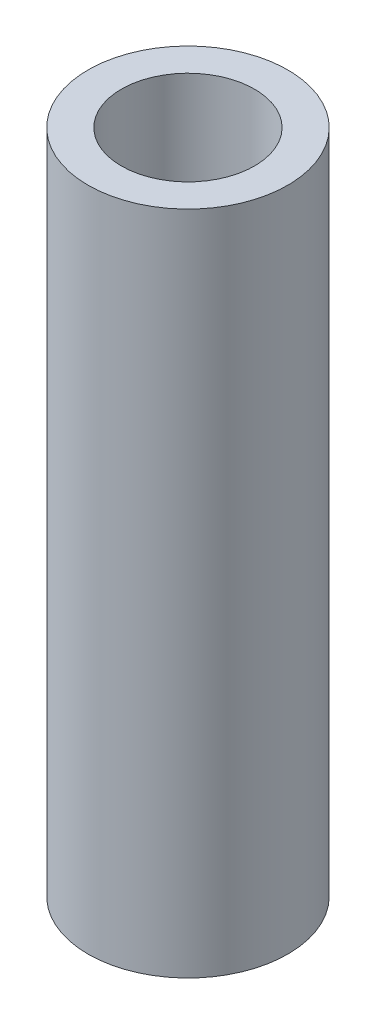
ISO-10303-21;
HEADER;
FILE_DESCRIPTION(('STEP AP214'),'2;1');
FILE_NAME('part.step','',(''),(''),'','','');
FILE_SCHEMA(('AUTOMOTIVE_DESIGN { 1 0 10303 214 1 1 1 1 }'));
ENDSEC;
DATA;
#1=APPLICATION_CONTEXT('core data for automotive mechanical design processes');
#2=APPLICATION_PROTOCOL_DEFINITION('international standard','automotive_design',2000,#1);
#3=PRODUCT_CONTEXT('',#1,'mechanical');
#4=PRODUCT('Part','Part','',(#3));
#5=PRODUCT_RELATED_PRODUCT_CATEGORY('part','',(#4));
#6=PRODUCT_DEFINITION_FORMATION('','',#4);
#7=PRODUCT_DEFINITION_CONTEXT('part definition',#1,'design');
#8=PRODUCT_DEFINITION('design','',#6,#7);
#9=PRODUCT_DEFINITION_SHAPE('','',#8);
#10=(LENGTH_UNIT() NAMED_UNIT(*) SI_UNIT(.MILLI.,.METRE.));
#11=(NAMED_UNIT(*) PLANE_ANGLE_UNIT() SI_UNIT($,.RADIAN.));
#12=(NAMED_UNIT(*) SI_UNIT($,.STERADIAN.) SOLID_ANGLE_UNIT());
#13=UNCERTAINTY_MEASURE_WITH_UNIT(LENGTH_MEASURE(1.E-05),#10,'distance_accuracy_value','');
#14=(GEOMETRIC_REPRESENTATION_CONTEXT(3) GLOBAL_UNCERTAINTY_ASSIGNED_CONTEXT((#13)) GLOBAL_UNIT_ASSIGNED_CONTEXT((#10,
#11,#12)) REPRESENTATION_CONTEXT('',''));
#15=CARTESIAN_POINT('',(0.,0.,0.));
#16=DIRECTION('',(0.,0.,1.));
#17=DIRECTION('',(1.,0.,0.));
#18=AXIS2_PLACEMENT_3D('',#15,#16,#17);
#19=CARTESIAN_POINT('',(0.,20.,0.));
#20=DIRECTION('',(0.,-1.,0.));
#21=DIRECTION('',(0.,0.,-1.));
#22=AXIS2_PLACEMENT_3D('',#19,#20,#21);
#23=CYLINDRICAL_SURFACE('',#22,3.);
#24=CARTESIAN_POINT('',(0.,20.,0.));
#25=DIRECTION('',(0.,1.,0.));
#26=DIRECTION('',(0.,0.,1.));
#27=AXIS2_PLACEMENT_3D('',#24,#25,#26);
#28=CIRCLE('',#27,3.);
#29=CARTESIAN_POINT('',(0.,20.,3.));
#30=VERTEX_POINT('',#29);
#31=EDGE_CURVE('E10',#30,#30,#28,.T.);
#32=ORIENTED_EDGE('',*,*,#31,.F.);
#33=EDGE_LOOP('',(#32));
#34=FACE_BOUND('',#33,.T.);
#35=CARTESIAN_POINT('',(0.,0.,0.));
#36=DIRECTION('',(0.,1.,0.));
#37=DIRECTION('',(0.,0.,1.));
#38=AXIS2_PLACEMENT_3D('',#35,#36,#37);
#39=CIRCLE('',#38,3.);
#40=CARTESIAN_POINT('',(0.,0.,3.));
#41=VERTEX_POINT('',#40);
#42=EDGE_CURVE('E34',#41,#41,#39,.T.);
#43=ORIENTED_EDGE('',*,*,#42,.T.);
#44=EDGE_LOOP('',(#43));
#45=FACE_BOUND('',#44,.T.);
#46=ADVANCED_FACE('F31',(#34,#45),#23,.T.);
#47=CARTESIAN_POINT('',(0.,20.,0.));
#48=DIRECTION('',(0.,1.,0.));
#49=DIRECTION('',(0.,0.,1.));
#50=AXIS2_PLACEMENT_3D('',#47,#48,#49);
#51=PLANE('',#50);
#52=CARTESIAN_POINT('',(0.,20.,0.));
#53=DIRECTION('',(0.,1.,0.));
#54=DIRECTION('',(0.,0.,1.));
#55=AXIS2_PLACEMENT_3D('',#52,#53,#54);
#56=CIRCLE('',#55,2.);
#57=CARTESIAN_POINT('',(0.,20.,2.));
#58=VERTEX_POINT('',#57);
#59=EDGE_CURVE('E43',#58,#58,#56,.T.);
#60=ORIENTED_EDGE('',*,*,#59,.F.);
#61=EDGE_LOOP('',(#60));
#62=FACE_BOUND('',#61,.T.);
#63=ORIENTED_EDGE('',*,*,#31,.T.);
#64=EDGE_LOOP('',(#63));
#65=FACE_BOUND('',#64,.T.);
#66=ADVANCED_FACE('F58',(#62,#65),#51,.T.);
#67=CARTESIAN_POINT('',(0.,0.,0.));
#68=DIRECTION('',(0.,1.,0.));
#69=DIRECTION('',(0.,0.,1.));
#70=AXIS2_PLACEMENT_3D('',#67,#68,#69);
#71=PLANE('',#70);
#72=CARTESIAN_POINT('',(0.,0.,0.));
#73=DIRECTION('',(0.,1.,0.));
#74=DIRECTION('',(0.,0.,1.));
#75=AXIS2_PLACEMENT_3D('',#72,#73,#74);
#76=CIRCLE('',#75,2.);
#77=CARTESIAN_POINT('',(0.,0.,2.));
#78=VERTEX_POINT('',#77);
#79=EDGE_CURVE('E41',#78,#78,#76,.T.);
#80=ORIENTED_EDGE('',*,*,#79,.T.);
#81=EDGE_LOOP('',(#80));
#82=FACE_BOUND('',#81,.T.);
#83=ORIENTED_EDGE('',*,*,#42,.F.);
#84=EDGE_LOOP('',(#83));
#85=FACE_BOUND('',#84,.T.);
#86=ADVANCED_FACE('F49',(#82,#85),#71,.F.);
#87=CARTESIAN_POINT('',(0.,0.,0.));
#88=DIRECTION('',(0.,1.,0.));
#89=DIRECTION('',(0.,0.,1.));
#90=AXIS2_PLACEMENT_3D('',#87,#88,#89);
#91=CYLINDRICAL_SURFACE('',#90,2.);
#92=ORIENTED_EDGE('',*,*,#79,.F.);
#93=EDGE_LOOP('',(#92));
#94=FACE_BOUND('',#93,.T.);
#95=ORIENTED_EDGE('',*,*,#59,.T.);
#96=EDGE_LOOP('',(#95));
#97=FACE_BOUND('',#96,.T.);
#98=ADVANCED_FACE('F52',(#94,#97),#91,.F.);
#99=CLOSED_SHELL('',(#46,#66,#86,#98));
#100=MANIFOLD_SOLID_BREP('B2',#99);
#101=ADVANCED_BREP_SHAPE_REPRESENTATION('',(#18,#100),#14);
#102=SHAPE_DEFINITION_REPRESENTATION(#9,#101);
ENDSEC;
END-ISO-10303-21;
